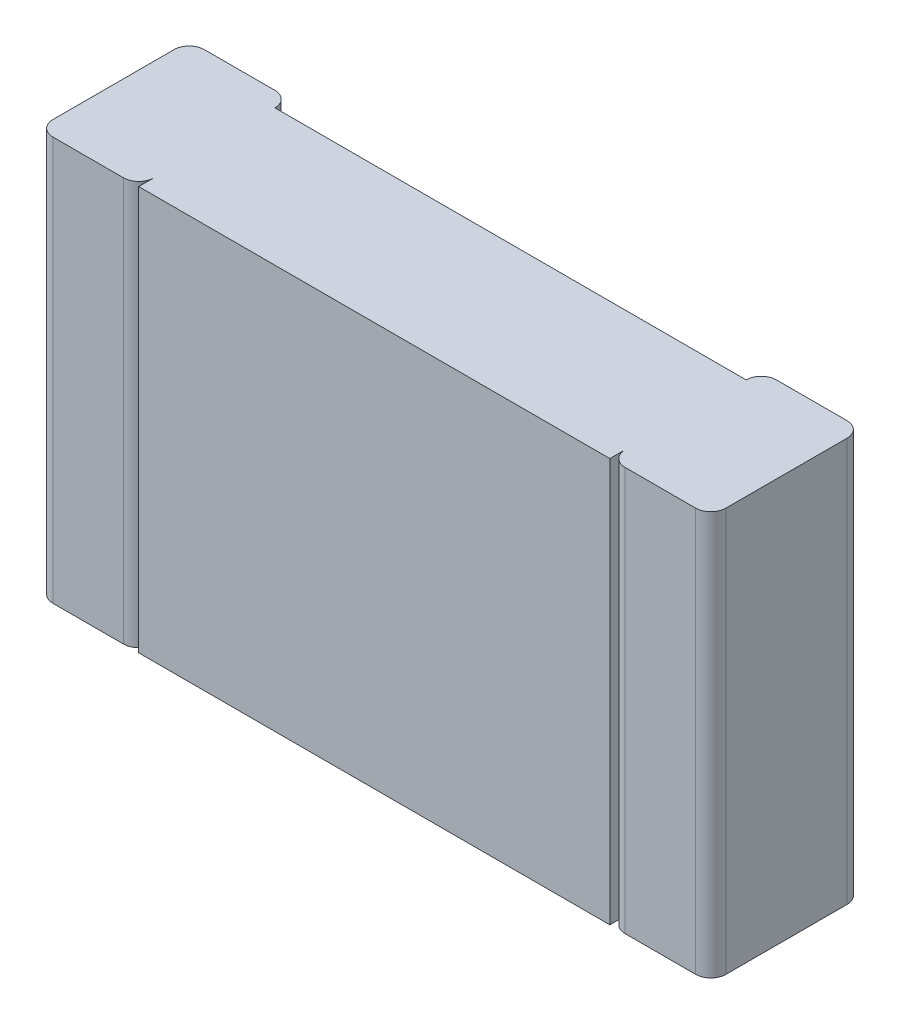
ISO-10303-21;
HEADER;
FILE_DESCRIPTION(('STEP AP214'),'2;1');
FILE_NAME('part.step','',(''),(''),'','','');
FILE_SCHEMA(('AUTOMOTIVE_DESIGN { 1 0 10303 214 1 1 1 1 }'));
ENDSEC;
DATA;
#1=APPLICATION_CONTEXT('core data for automotive mechanical design processes');
#2=APPLICATION_PROTOCOL_DEFINITION('international standard','automotive_design',2000,#1);
#3=PRODUCT_CONTEXT('',#1,'mechanical');
#4=PRODUCT('Part','Part','',(#3));
#5=PRODUCT_RELATED_PRODUCT_CATEGORY('part','',(#4));
#6=PRODUCT_DEFINITION_FORMATION('','',#4);
#7=PRODUCT_DEFINITION_CONTEXT('part definition',#1,'design');
#8=PRODUCT_DEFINITION('design','',#6,#7);
#9=PRODUCT_DEFINITION_SHAPE('','',#8);
#10=(LENGTH_UNIT() NAMED_UNIT(*) SI_UNIT(.MILLI.,.METRE.));
#11=(NAMED_UNIT(*) PLANE_ANGLE_UNIT() SI_UNIT($,.RADIAN.));
#12=(NAMED_UNIT(*) SI_UNIT($,.STERADIAN.) SOLID_ANGLE_UNIT());
#13=UNCERTAINTY_MEASURE_WITH_UNIT(LENGTH_MEASURE(1.E-05),#10,'distance_accuracy_value','');
#14=(GEOMETRIC_REPRESENTATION_CONTEXT(3) GLOBAL_UNCERTAINTY_ASSIGNED_CONTEXT((#13)) GLOBAL_UNIT_ASSIGNED_CONTEXT((#10,
#11,#12)) REPRESENTATION_CONTEXT('',''));
#15=CARTESIAN_POINT('',(0.,0.,0.));
#16=DIRECTION('',(0.,0.,1.));
#17=DIRECTION('',(1.,0.,0.));
#18=AXIS2_PLACEMENT_3D('',#15,#16,#17);
#19=CARTESIAN_POINT('',(-0.955,-0.6,0.045));
#20=DIRECTION('',(0.,1.,0.));
#21=DIRECTION('',(0.,0.,1.));
#22=AXIS2_PLACEMENT_3D('',#19,#20,#21);
#23=CYLINDRICAL_SURFACE('',#22,0.045);
#24=DIRECTION('',(0.,1.,0.));
#25=VECTOR('',#24,1.);
#26=CARTESIAN_POINT('',(-0.955,-0.6,0.));
#27=LINE('',#26,#25);
#28=CARTESIAN_POINT('',(-0.955,0.6,0.));
#29=VERTEX_POINT('',#28);
#30=CARTESIAN_POINT('',(-0.955,-0.6,0.));
#31=VERTEX_POINT('',#30);
#32=EDGE_CURVE('E129',#29,#31,#27,.F.);
#33=ORIENTED_EDGE('',*,*,#32,.T.);
#34=CARTESIAN_POINT('',(-0.955,-0.6,0.045));
#35=DIRECTION('',(0.,1.,0.));
#36=DIRECTION('',(0.,0.,1.));
#37=AXIS2_PLACEMENT_3D('',#34,#35,#36);
#38=CIRCLE('',#37,0.045);
#39=CARTESIAN_POINT('',(-1.,-0.6,0.045));
#40=VERTEX_POINT('',#39);
#41=EDGE_CURVE('E20',#31,#40,#38,.T.);
#42=ORIENTED_EDGE('',*,*,#41,.T.);
#43=DIRECTION('',(0.,1.,0.));
#44=VECTOR('',#43,1.);
#45=CARTESIAN_POINT('',(-1.,-0.6,0.045));
#46=LINE('',#45,#44);
#47=CARTESIAN_POINT('',(-1.,0.6,0.045));
#48=VERTEX_POINT('',#47);
#49=EDGE_CURVE('E136',#40,#48,#46,.T.);
#50=ORIENTED_EDGE('',*,*,#49,.T.);
#51=CARTESIAN_POINT('',(-0.955,0.6,0.045));
#52=DIRECTION('',(0.,1.,0.));
#53=DIRECTION('',(0.,0.,1.));
#54=AXIS2_PLACEMENT_3D('',#51,#52,#53);
#55=CIRCLE('',#54,0.045);
#56=EDGE_CURVE('E232',#29,#48,#55,.T.);
#57=ORIENTED_EDGE('',*,*,#56,.F.);
#58=EDGE_LOOP('',(#33,#42,#50,#57));
#59=FACE_BOUND('',#58,.T.);
#60=ADVANCED_FACE('F17',(#59),#23,.T.);
#61=CARTESIAN_POINT('',(-1.,-0.6,0.));
#62=DIRECTION('',(1.,0.,0.));
#63=DIRECTION('',(0.,0.,-1.));
#64=AXIS2_PLACEMENT_3D('',#61,#62,#63);
#65=PLANE('',#64);
#66=DIRECTION('',(0.,0.,1.));
#67=VECTOR('',#66,1.);
#68=CARTESIAN_POINT('',(-1.,0.6,0.));
#69=LINE('',#68,#67);
#70=CARTESIAN_POINT('',(-1.,0.6,0.405));
#71=VERTEX_POINT('',#70);
#72=EDGE_CURVE('E141',#48,#71,#69,.T.);
#73=ORIENTED_EDGE('',*,*,#72,.F.);
#74=ORIENTED_EDGE('',*,*,#49,.F.);
#75=DIRECTION('',(0.,0.,1.));
#76=VECTOR('',#75,1.);
#77=CARTESIAN_POINT('',(-1.,-0.6,0.));
#78=LINE('',#77,#76);
#79=CARTESIAN_POINT('',(-1.,-0.6,0.405));
#80=VERTEX_POINT('',#79);
#81=EDGE_CURVE('E140',#40,#80,#78,.T.);
#82=ORIENTED_EDGE('',*,*,#81,.T.);
#83=DIRECTION('',(0.,1.,0.));
#84=VECTOR('',#83,1.);
#85=CARTESIAN_POINT('',(-1.,-0.6,0.405));
#86=LINE('',#85,#84);
#87=EDGE_CURVE('E142',#71,#80,#86,.F.);
#88=ORIENTED_EDGE('',*,*,#87,.F.);
#89=EDGE_LOOP('',(#73,#74,#82,#88));
#90=FACE_BOUND('',#89,.T.);
#91=ADVANCED_FACE('F138',(#90),#65,.F.);
#92=CARTESIAN_POINT('',(-0.955,-0.6,0.405));
#93=DIRECTION('',(0.,1.,0.));
#94=DIRECTION('',(0.,0.,1.));
#95=AXIS2_PLACEMENT_3D('',#92,#93,#94);
#96=CYLINDRICAL_SURFACE('',#95,0.045);
#97=CARTESIAN_POINT('',(-0.955,0.6,0.405));
#98=DIRECTION('',(0.,1.,0.));
#99=DIRECTION('',(0.,0.,1.));
#100=AXIS2_PLACEMENT_3D('',#97,#98,#99);
#101=CIRCLE('',#100,0.045);
#102=CARTESIAN_POINT('',(-0.955,0.6,0.45));
#103=VERTEX_POINT('',#102);
#104=EDGE_CURVE('E230',#71,#103,#101,.T.);
#105=ORIENTED_EDGE('',*,*,#104,.F.);
#106=ORIENTED_EDGE('',*,*,#87,.T.);
#107=CARTESIAN_POINT('',(-0.955,-0.6,0.405));
#108=DIRECTION('',(0.,1.,0.));
#109=DIRECTION('',(0.,0.,1.));
#110=AXIS2_PLACEMENT_3D('',#107,#108,#109);
#111=CIRCLE('',#110,0.045);
#112=CARTESIAN_POINT('',(-0.955,-0.6,0.45));
#113=VERTEX_POINT('',#112);
#114=EDGE_CURVE('E151',#80,#113,#111,.T.);
#115=ORIENTED_EDGE('',*,*,#114,.T.);
#116=DIRECTION('',(0.,1.,0.));
#117=VECTOR('',#116,1.);
#118=CARTESIAN_POINT('',(-0.955,-0.6,0.45));
#119=LINE('',#118,#117);
#120=EDGE_CURVE('E200',#103,#113,#119,.F.);
#121=ORIENTED_EDGE('',*,*,#120,.F.);
#122=EDGE_LOOP('',(#105,#106,#115,#121));
#123=FACE_BOUND('',#122,.T.);
#124=ADVANCED_FACE('F457',(#123),#96,.T.);
#125=CARTESIAN_POINT('',(-1.,-0.6,0.45));
#126=DIRECTION('',(0.,0.,1.));
#127=DIRECTION('',(1.,0.,0.));
#128=AXIS2_PLACEMENT_3D('',#125,#126,#127);
#129=PLANE('',#128);
#130=DIRECTION('',(1.,0.,0.));
#131=VECTOR('',#130,1.);
#132=CARTESIAN_POINT('',(-1.,-0.6,0.45));
#133=LINE('',#132,#131);
#134=CARTESIAN_POINT('',(-0.745,-0.6,0.45));
#135=VERTEX_POINT('',#134);
#136=EDGE_CURVE('E248',#113,#135,#133,.T.);
#137=ORIENTED_EDGE('',*,*,#136,.T.);
#138=DIRECTION('',(0.,1.,0.));
#139=VECTOR('',#138,1.);
#140=CARTESIAN_POINT('',(-0.745,-0.6,0.45));
#141=LINE('',#140,#139);
#142=CARTESIAN_POINT('',(-0.745,0.6,0.45));
#143=VERTEX_POINT('',#142);
#144=EDGE_CURVE('E198',#143,#135,#141,.F.);
#145=ORIENTED_EDGE('',*,*,#144,.F.);
#146=DIRECTION('',(1.,0.,0.));
#147=VECTOR('',#146,1.);
#148=CARTESIAN_POINT('',(-1.,0.6,0.45));
#149=LINE('',#148,#147);
#150=EDGE_CURVE('E229',#103,#143,#149,.T.);
#151=ORIENTED_EDGE('',*,*,#150,.F.);
#152=ORIENTED_EDGE('',*,*,#120,.T.);
#153=EDGE_LOOP('',(#137,#145,#151,#152));
#154=FACE_BOUND('',#153,.T.);
#155=ADVANCED_FACE('F447',(#154),#129,.T.);
#156=CARTESIAN_POINT('',(-0.745,-0.6,0.405));
#157=DIRECTION('',(0.,1.,0.));
#158=DIRECTION('',(0.,0.,1.));
#159=AXIS2_PLACEMENT_3D('',#156,#157,#158);
#160=CYLINDRICAL_SURFACE('',#159,0.045);
#161=ORIENTED_EDGE('',*,*,#144,.T.);
#162=CARTESIAN_POINT('',(-0.745,-0.6,0.405));
#163=DIRECTION('',(0.,1.,0.));
#164=DIRECTION('',(0.,0.,1.));
#165=AXIS2_PLACEMENT_3D('',#162,#163,#164);
#166=CIRCLE('',#165,0.045);
#167=CARTESIAN_POINT('',(-0.7,-0.6,0.405));
#168=VERTEX_POINT('',#167);
#169=EDGE_CURVE('E246',#135,#168,#166,.T.);
#170=ORIENTED_EDGE('',*,*,#169,.T.);
#171=DIRECTION('',(0.,1.,0.));
#172=VECTOR('',#171,1.);
#173=CARTESIAN_POINT('',(-0.7,-0.6,0.405));
#174=LINE('',#173,#172);
#175=CARTESIAN_POINT('',(-0.7,0.6,0.405));
#176=VERTEX_POINT('',#175);
#177=EDGE_CURVE('E193',#168,#176,#174,.T.);
#178=ORIENTED_EDGE('',*,*,#177,.T.);
#179=CARTESIAN_POINT('',(-0.745,0.6,0.405));
#180=DIRECTION('',(0.,1.,0.));
#181=DIRECTION('',(0.,0.,1.));
#182=AXIS2_PLACEMENT_3D('',#179,#180,#181);
#183=CIRCLE('',#182,0.045);
#184=EDGE_CURVE('E227',#143,#176,#183,.T.);
#185=ORIENTED_EDGE('',*,*,#184,.F.);
#186=EDGE_LOOP('',(#161,#170,#178,#185));
#187=FACE_BOUND('',#186,.T.);
#188=ADVANCED_FACE('F435',(#187),#160,.T.);
#189=CARTESIAN_POINT('',(-0.7,-0.6,0.405));
#190=DIRECTION('',(1.,0.,0.));
#191=DIRECTION('',(0.,0.,-1.));
#192=AXIS2_PLACEMENT_3D('',#189,#190,#191);
#193=PLANE('',#192);
#194=DIRECTION('',(0.,0.,1.));
#195=VECTOR('',#194,1.);
#196=CARTESIAN_POINT('',(-0.7,0.6,0.405));
#197=LINE('',#196,#195);
#198=CARTESIAN_POINT('',(-0.7,0.6,0.45));
#199=VERTEX_POINT('',#198);
#200=EDGE_CURVE('E188',#176,#199,#197,.T.);
#201=ORIENTED_EDGE('',*,*,#200,.F.);
#202=ORIENTED_EDGE('',*,*,#177,.F.);
#203=DIRECTION('',(0.,0.,1.));
#204=VECTOR('',#203,1.);
#205=CARTESIAN_POINT('',(-0.7,-0.6,0.405));
#206=LINE('',#205,#204);
#207=CARTESIAN_POINT('',(-0.7,-0.6,0.45));
#208=VERTEX_POINT('',#207);
#209=EDGE_CURVE('E206',#168,#208,#206,.T.);
#210=ORIENTED_EDGE('',*,*,#209,.T.);
#211=DIRECTION('',(0.,1.,0.));
#212=VECTOR('',#211,1.);
#213=CARTESIAN_POINT('',(-0.7,-0.6,0.45));
#214=LINE('',#213,#212);
#215=EDGE_CURVE('E181',#199,#208,#214,.F.);
#216=ORIENTED_EDGE('',*,*,#215,.F.);
#217=EDGE_LOOP('',(#201,#202,#210,#216));
#218=FACE_BOUND('',#217,.T.);
#219=ADVANCED_FACE('F425',(#218),#193,.F.);
#220=CARTESIAN_POINT('',(-0.7,-0.6,0.45));
#221=DIRECTION('',(0.,0.,1.));
#222=DIRECTION('',(1.,0.,0.));
#223=AXIS2_PLACEMENT_3D('',#220,#221,#222);
#224=PLANE('',#223);
#225=DIRECTION('',(0.,1.,0.));
#226=VECTOR('',#225,1.);
#227=CARTESIAN_POINT('',(0.7,-0.6,0.45));
#228=LINE('',#227,#226);
#229=CARTESIAN_POINT('',(0.7,0.6,0.45));
#230=VERTEX_POINT('',#229);
#231=CARTESIAN_POINT('',(0.7,-0.6,0.45));
#232=VERTEX_POINT('',#231);
#233=EDGE_CURVE('E174',#230,#232,#228,.F.);
#234=ORIENTED_EDGE('',*,*,#233,.F.);
#235=DIRECTION('',(1.,0.,0.));
#236=VECTOR('',#235,1.);
#237=CARTESIAN_POINT('',(-0.7,0.6,0.45));
#238=LINE('',#237,#236);
#239=EDGE_CURVE('E184',#199,#230,#238,.T.);
#240=ORIENTED_EDGE('',*,*,#239,.F.);
#241=ORIENTED_EDGE('',*,*,#215,.T.);
#242=DIRECTION('',(1.,0.,0.));
#243=VECTOR('',#242,1.);
#244=CARTESIAN_POINT('',(-0.7,-0.6,0.45));
#245=LINE('',#244,#243);
#246=EDGE_CURVE('E203',#208,#232,#245,.T.);
#247=ORIENTED_EDGE('',*,*,#246,.T.);
#248=EDGE_LOOP('',(#234,#240,#241,#247));
#249=FACE_BOUND('',#248,.T.);
#250=ADVANCED_FACE('F412',(#249),#224,.T.);
#251=CARTESIAN_POINT('',(0.7,-0.6,0.405));
#252=DIRECTION('',(1.,0.,0.));
#253=DIRECTION('',(0.,0.,-1.));
#254=AXIS2_PLACEMENT_3D('',#251,#252,#253);
#255=PLANE('',#254);
#256=DIRECTION('',(0.,0.,1.));
#257=VECTOR('',#256,1.);
#258=CARTESIAN_POINT('',(0.7,0.6,0.405));
#259=LINE('',#258,#257);
#260=CARTESIAN_POINT('',(0.7,0.6,0.405));
#261=VERTEX_POINT('',#260);
#262=EDGE_CURVE('E187',#230,#261,#259,.F.);
#263=ORIENTED_EDGE('',*,*,#262,.F.);
#264=ORIENTED_EDGE('',*,*,#233,.T.);
#265=DIRECTION('',(0.,0.,1.));
#266=VECTOR('',#265,1.);
#267=CARTESIAN_POINT('',(0.7,-0.6,0.405));
#268=LINE('',#267,#266);
#269=CARTESIAN_POINT('',(0.7,-0.6,0.405));
#270=VERTEX_POINT('',#269);
#271=EDGE_CURVE('E178',#232,#270,#268,.F.);
#272=ORIENTED_EDGE('',*,*,#271,.T.);
#273=DIRECTION('',(0.,1.,0.));
#274=VECTOR('',#273,1.);
#275=CARTESIAN_POINT('',(0.7,-0.6,0.405));
#276=LINE('',#275,#274);
#277=EDGE_CURVE('E172',#261,#270,#276,.F.);
#278=ORIENTED_EDGE('',*,*,#277,.F.);
#279=EDGE_LOOP('',(#263,#264,#272,#278));
#280=FACE_BOUND('',#279,.T.);
#281=ADVANCED_FACE('F377',(#280),#255,.T.);
#282=CARTESIAN_POINT('',(0.745,-0.6,0.405));
#283=DIRECTION('',(0.,1.,0.));
#284=DIRECTION('',(0.,0.,1.));
#285=AXIS2_PLACEMENT_3D('',#282,#283,#284);
#286=CYLINDRICAL_SURFACE('',#285,0.045);
#287=CARTESIAN_POINT('',(0.745,0.6,0.405));
#288=DIRECTION('',(0.,1.,0.));
#289=DIRECTION('',(0.,0.,1.));
#290=AXIS2_PLACEMENT_3D('',#287,#288,#289);
#291=CIRCLE('',#290,0.045);
#292=CARTESIAN_POINT('',(0.745,0.6,0.45));
#293=VERTEX_POINT('',#292);
#294=EDGE_CURVE('E224',#261,#293,#291,.T.);
#295=ORIENTED_EDGE('',*,*,#294,.F.);
#296=ORIENTED_EDGE('',*,*,#277,.T.);
#297=CARTESIAN_POINT('',(0.745,-0.6,0.405));
#298=DIRECTION('',(0.,1.,0.));
#299=DIRECTION('',(0.,0.,1.));
#300=AXIS2_PLACEMENT_3D('',#297,#298,#299);
#301=CIRCLE('',#300,0.045);
#302=CARTESIAN_POINT('',(0.745,-0.6,0.45));
#303=VERTEX_POINT('',#302);
#304=EDGE_CURVE('E243',#270,#303,#301,.T.);
#305=ORIENTED_EDGE('',*,*,#304,.T.);
#306=DIRECTION('',(0.,1.,0.));
#307=VECTOR('',#306,1.);
#308=CARTESIAN_POINT('',(0.745,-0.6,0.45));
#309=LINE('',#308,#307);
#310=EDGE_CURVE('E170',#293,#303,#309,.F.);
#311=ORIENTED_EDGE('',*,*,#310,.F.);
#312=EDGE_LOOP('',(#295,#296,#305,#311));
#313=FACE_BOUND('',#312,.T.);
#314=ADVANCED_FACE('F411',(#313),#286,.T.);
#315=CARTESIAN_POINT('',(0.7,-0.6,0.45));
#316=DIRECTION('',(0.,0.,1.));
#317=DIRECTION('',(1.,0.,0.));
#318=AXIS2_PLACEMENT_3D('',#315,#316,#317);
#319=PLANE('',#318);
#320=DIRECTION('',(1.,0.,0.));
#321=VECTOR('',#320,1.);
#322=CARTESIAN_POINT('',(0.7,-0.6,0.45));
#323=LINE('',#322,#321);
#324=CARTESIAN_POINT('',(0.955,-0.6,0.45));
#325=VERTEX_POINT('',#324);
#326=EDGE_CURVE('E242',#303,#325,#323,.T.);
#327=ORIENTED_EDGE('',*,*,#326,.T.);
#328=DIRECTION('',(0.,1.,0.));
#329=VECTOR('',#328,1.);
#330=CARTESIAN_POINT('',(0.955,-0.6,0.45));
#331=LINE('',#330,#329);
#332=CARTESIAN_POINT('',(0.955,0.6,0.45));
#333=VERTEX_POINT('',#332);
#334=EDGE_CURVE('E168',#333,#325,#331,.F.);
#335=ORIENTED_EDGE('',*,*,#334,.F.);
#336=DIRECTION('',(1.,0.,0.));
#337=VECTOR('',#336,1.);
#338=CARTESIAN_POINT('',(0.7,0.6,0.45));
#339=LINE('',#338,#337);
#340=EDGE_CURVE('E223',#293,#333,#339,.T.);
#341=ORIENTED_EDGE('',*,*,#340,.F.);
#342=ORIENTED_EDGE('',*,*,#310,.T.);
#343=EDGE_LOOP('',(#327,#335,#341,#342));
#344=FACE_BOUND('',#343,.T.);
#345=ADVANCED_FACE('F488',(#344),#319,.T.);
#346=CARTESIAN_POINT('',(0.955,-0.6,0.405));
#347=DIRECTION('',(0.,1.,0.));
#348=DIRECTION('',(0.,0.,1.));
#349=AXIS2_PLACEMENT_3D('',#346,#347,#348);
#350=CYLINDRICAL_SURFACE('',#349,0.045);
#351=ORIENTED_EDGE('',*,*,#334,.T.);
#352=CARTESIAN_POINT('',(0.955,-0.6,0.405));
#353=DIRECTION('',(0.,1.,0.));
#354=DIRECTION('',(0.,0.,1.));
#355=AXIS2_PLACEMENT_3D('',#352,#353,#354);
#356=CIRCLE('',#355,0.045);
#357=CARTESIAN_POINT('',(1.,-0.6,0.405));
#358=VERTEX_POINT('',#357);
#359=EDGE_CURVE('E239',#325,#358,#356,.T.);
#360=ORIENTED_EDGE('',*,*,#359,.T.);
#361=DIRECTION('',(0.,1.,0.));
#362=VECTOR('',#361,1.);
#363=CARTESIAN_POINT('',(1.,-0.6,0.405));
#364=LINE('',#363,#362);
#365=CARTESIAN_POINT('',(1.,0.6,0.405));
#366=VERTEX_POINT('',#365);
#367=EDGE_CURVE('E166',#366,#358,#364,.F.);
#368=ORIENTED_EDGE('',*,*,#367,.F.);
#369=CARTESIAN_POINT('',(0.955,0.6,0.405));
#370=DIRECTION('',(0.,1.,0.));
#371=DIRECTION('',(0.,0.,1.));
#372=AXIS2_PLACEMENT_3D('',#369,#370,#371);
#373=CIRCLE('',#372,0.045);
#374=EDGE_CURVE('E221',#333,#366,#373,.T.);
#375=ORIENTED_EDGE('',*,*,#374,.F.);
#376=EDGE_LOOP('',(#351,#360,#368,#375));
#377=FACE_BOUND('',#376,.T.);
#378=ADVANCED_FACE('F492',(#377),#350,.T.);
#379=CARTESIAN_POINT('',(1.,-0.6,0.));
#380=DIRECTION('',(1.,0.,0.));
#381=DIRECTION('',(0.,0.,-1.));
#382=AXIS2_PLACEMENT_3D('',#379,#380,#381);
#383=PLANE('',#382);
#384=DIRECTION('',(0.,0.,1.));
#385=VECTOR('',#384,1.);
#386=CARTESIAN_POINT('',(1.,0.6,0.));
#387=LINE('',#386,#385);
#388=CARTESIAN_POINT('',(1.,0.6,0.045));
#389=VERTEX_POINT('',#388);
#390=EDGE_CURVE('E220',#366,#389,#387,.F.);
#391=ORIENTED_EDGE('',*,*,#390,.F.);
#392=ORIENTED_EDGE('',*,*,#367,.T.);
#393=DIRECTION('',(0.,0.,1.));
#394=VECTOR('',#393,1.);
#395=CARTESIAN_POINT('',(1.,-0.6,0.));
#396=LINE('',#395,#394);
#397=CARTESIAN_POINT('',(1.,-0.6,0.045));
#398=VERTEX_POINT('',#397);
#399=EDGE_CURVE('E238',#358,#398,#396,.F.);
#400=ORIENTED_EDGE('',*,*,#399,.T.);
#401=DIRECTION('',(0.,1.,0.));
#402=VECTOR('',#401,1.);
#403=CARTESIAN_POINT('',(1.,-0.6,0.045));
#404=LINE('',#403,#402);
#405=EDGE_CURVE('E157',#389,#398,#404,.F.);
#406=ORIENTED_EDGE('',*,*,#405,.F.);
#407=EDGE_LOOP('',(#391,#392,#400,#406));
#408=FACE_BOUND('',#407,.T.);
#409=ADVANCED_FACE('F298',(#408),#383,.T.);
#410=CARTESIAN_POINT('',(0.955,-0.6,0.045));
#411=DIRECTION('',(0.,1.,0.));
#412=DIRECTION('',(0.,0.,1.));
#413=AXIS2_PLACEMENT_3D('',#410,#411,#412);
#414=CYLINDRICAL_SURFACE('',#413,0.045);
#415=CARTESIAN_POINT('',(0.955,0.6,0.045));
#416=DIRECTION('',(0.,1.,0.));
#417=DIRECTION('',(0.,0.,1.));
#418=AXIS2_PLACEMENT_3D('',#415,#416,#417);
#419=CIRCLE('',#418,0.045);
#420=CARTESIAN_POINT('',(0.955,0.6,0.));
#421=VERTEX_POINT('',#420);
#422=EDGE_CURVE('E217',#389,#421,#419,.T.);
#423=ORIENTED_EDGE('',*,*,#422,.F.);
#424=ORIENTED_EDGE('',*,*,#405,.T.);
#425=CARTESIAN_POINT('',(0.955,-0.6,0.045));
#426=DIRECTION('',(0.,1.,0.));
#427=DIRECTION('',(0.,0.,1.));
#428=AXIS2_PLACEMENT_3D('',#425,#426,#427);
#429=CIRCLE('',#428,0.045);
#430=CARTESIAN_POINT('',(0.955,-0.6,0.));
#431=VERTEX_POINT('',#430);
#432=EDGE_CURVE('E235',#398,#431,#429,.T.);
#433=ORIENTED_EDGE('',*,*,#432,.T.);
#434=DIRECTION('',(0.,1.,0.));
#435=VECTOR('',#434,1.);
#436=CARTESIAN_POINT('',(0.955,-0.6,0.));
#437=LINE('',#436,#435);
#438=EDGE_CURVE('E175',#431,#421,#437,.T.);
#439=ORIENTED_EDGE('',*,*,#438,.T.);
#440=EDGE_LOOP('',(#423,#424,#433,#439));
#441=FACE_BOUND('',#440,.T.);
#442=ADVANCED_FACE('F302',(#441),#414,.T.);
#443=CARTESIAN_POINT('',(-1.,-0.6,0.));
#444=DIRECTION('',(0.,0.,1.));
#445=DIRECTION('',(1.,0.,0.));
#446=AXIS2_PLACEMENT_3D('',#443,#444,#445);
#447=PLANE('',#446);
#448=DIRECTION('',(1.,0.,0.));
#449=VECTOR('',#448,1.);
#450=CARTESIAN_POINT('',(-1.,-0.6,0.));
#451=LINE('',#450,#449);
#452=CARTESIAN_POINT('',(-0.745,-0.6,0.));
#453=VERTEX_POINT('',#452);
#454=EDGE_CURVE('E153',#453,#31,#451,.F.);
#455=ORIENTED_EDGE('',*,*,#454,.T.);
#456=ORIENTED_EDGE('',*,*,#32,.F.);
#457=DIRECTION('',(1.,0.,0.));
#458=VECTOR('',#457,1.);
#459=CARTESIAN_POINT('',(-1.,0.6,0.));
#460=LINE('',#459,#458);
#461=CARTESIAN_POINT('',(-0.745,0.6,0.));
#462=VERTEX_POINT('',#461);
#463=EDGE_CURVE('E234',#462,#29,#460,.F.);
#464=ORIENTED_EDGE('',*,*,#463,.F.);
#465=DIRECTION('',(0.,1.,0.));
#466=VECTOR('',#465,1.);
#467=CARTESIAN_POINT('',(-0.745,-0.6,0.));
#468=LINE('',#467,#466);
#469=EDGE_CURVE('E161',#453,#462,#468,.T.);
#470=ORIENTED_EDGE('',*,*,#469,.F.);
#471=EDGE_LOOP('',(#455,#456,#464,#470));
#472=FACE_BOUND('',#471,.T.);
#473=ADVANCED_FACE('F319',(#472),#447,.F.);
#474=CARTESIAN_POINT('',(0.7,-0.6,0.));
#475=DIRECTION('',(0.,0.,1.));
#476=DIRECTION('',(1.,0.,0.));
#477=AXIS2_PLACEMENT_3D('',#474,#475,#476);
#478=PLANE('',#477);
#479=DIRECTION('',(1.,0.,0.));
#480=VECTOR('',#479,1.);
#481=CARTESIAN_POINT('',(0.7,-0.6,0.));
#482=LINE('',#481,#480);
#483=CARTESIAN_POINT('',(0.745,-0.6,0.));
#484=VERTEX_POINT('',#483);
#485=EDGE_CURVE('E177',#431,#484,#482,.F.);
#486=ORIENTED_EDGE('',*,*,#485,.T.);
#487=DIRECTION('',(0.,1.,0.));
#488=VECTOR('',#487,1.);
#489=CARTESIAN_POINT('',(0.745,-0.6,0.));
#490=LINE('',#489,#488);
#491=CARTESIAN_POINT('',(0.745,0.6,0.));
#492=VERTEX_POINT('',#491);
#493=EDGE_CURVE('E212',#492,#484,#490,.F.);
#494=ORIENTED_EDGE('',*,*,#493,.F.);
#495=DIRECTION('',(1.,0.,0.));
#496=VECTOR('',#495,1.);
#497=CARTESIAN_POINT('',(0.7,0.6,0.));
#498=LINE('',#497,#496);
#499=EDGE_CURVE('E226',#421,#492,#498,.F.);
#500=ORIENTED_EDGE('',*,*,#499,.F.);
#501=ORIENTED_EDGE('',*,*,#438,.F.);
#502=EDGE_LOOP('',(#486,#494,#500,#501));
#503=FACE_BOUND('',#502,.T.);
#504=ADVANCED_FACE('F305',(#503),#478,.F.);
#505=CARTESIAN_POINT('',(-0.745,-0.6,0.045));
#506=DIRECTION('',(0.,1.,0.));
#507=DIRECTION('',(0.,0.,1.));
#508=AXIS2_PLACEMENT_3D('',#505,#506,#507);
#509=CYLINDRICAL_SURFACE('',#508,0.045);
#510=CARTESIAN_POINT('',(-0.745,0.6,0.045));
#511=DIRECTION('',(0.,1.,0.));
#512=DIRECTION('',(0.,0.,1.));
#513=AXIS2_PLACEMENT_3D('',#510,#511,#512);
#514=CIRCLE('',#513,0.045);
#515=CARTESIAN_POINT('',(-0.7,0.6,0.045));
#516=VERTEX_POINT('',#515);
#517=EDGE_CURVE('E163',#462,#516,#514,.F.);
#518=ORIENTED_EDGE('',*,*,#517,.T.);
#519=DIRECTION('',(0.,1.,0.));
#520=VECTOR('',#519,1.);
#521=CARTESIAN_POINT('',(-0.7,-0.6,0.045));
#522=LINE('',#521,#520);
#523=CARTESIAN_POINT('',(-0.7,-0.6,0.045));
#524=VERTEX_POINT('',#523);
#525=EDGE_CURVE('E211',#516,#524,#522,.F.);
#526=ORIENTED_EDGE('',*,*,#525,.T.);
#527=CARTESIAN_POINT('',(-0.745,-0.6,0.045));
#528=DIRECTION('',(0.,1.,0.));
#529=DIRECTION('',(0.,0.,1.));
#530=AXIS2_PLACEMENT_3D('',#527,#528,#529);
#531=CIRCLE('',#530,0.045);
#532=EDGE_CURVE('E164',#524,#453,#531,.T.);
#533=ORIENTED_EDGE('',*,*,#532,.T.);
#534=ORIENTED_EDGE('',*,*,#469,.T.);
#535=EDGE_LOOP('',(#518,#526,#533,#534));
#536=FACE_BOUND('',#535,.T.);
#537=ADVANCED_FACE('F318',(#536),#509,.T.);
#538=CARTESIAN_POINT('',(-0.955,-0.6,0.045));
#539=DIRECTION('',(0.,1.,0.));
#540=DIRECTION('',(0.,0.,1.));
#541=AXIS2_PLACEMENT_3D('',#538,#539,#540);
#542=PLANE('',#541);
#543=DIRECTION('',(1.,0.,0.));
#544=VECTOR('',#543,1.);
#545=CARTESIAN_POINT('',(-0.955,-0.6,0.045));
#546=LINE('',#545,#544);
#547=CARTESIAN_POINT('',(0.7,-0.6,0.045));
#548=VERTEX_POINT('',#547);
#549=EDGE_CURVE('E263',#524,#548,#546,.T.);
#550=ORIENTED_EDGE('',*,*,#549,.T.);
#551=CARTESIAN_POINT('',(0.745,-0.6,0.045));
#552=DIRECTION('',(0.,1.,0.));
#553=DIRECTION('',(0.,0.,1.));
#554=AXIS2_PLACEMENT_3D('',#551,#552,#553);
#555=CIRCLE('',#554,0.045);
#556=EDGE_CURVE('E209',#484,#548,#555,.T.);
#557=ORIENTED_EDGE('',*,*,#556,.F.);
#558=ORIENTED_EDGE('',*,*,#485,.F.);
#559=ORIENTED_EDGE('',*,*,#432,.F.);
#560=ORIENTED_EDGE('',*,*,#399,.F.);
#561=ORIENTED_EDGE('',*,*,#359,.F.);
#562=ORIENTED_EDGE('',*,*,#326,.F.);
#563=ORIENTED_EDGE('',*,*,#304,.F.);
#564=ORIENTED_EDGE('',*,*,#271,.F.);
#565=ORIENTED_EDGE('',*,*,#246,.F.);
#566=ORIENTED_EDGE('',*,*,#209,.F.);
#567=ORIENTED_EDGE('',*,*,#169,.F.);
#568=ORIENTED_EDGE('',*,*,#136,.F.);
#569=ORIENTED_EDGE('',*,*,#114,.F.);
#570=ORIENTED_EDGE('',*,*,#81,.F.);
#571=ORIENTED_EDGE('',*,*,#41,.F.);
#572=ORIENTED_EDGE('',*,*,#454,.F.);
#573=ORIENTED_EDGE('',*,*,#532,.F.);
#574=EDGE_LOOP('',(#550,#557,#558,#559,#560,#561,#562,#563,#564,#565,#566,#567,#568,#569,#570,
#571,#572,#573));
#575=FACE_BOUND('',#574,.T.);
#576=ADVANCED_FACE('F147',(#575),#542,.F.);
#577=CARTESIAN_POINT('',(0.745,-0.6,0.045));
#578=DIRECTION('',(0.,1.,0.));
#579=DIRECTION('',(0.,0.,1.));
#580=AXIS2_PLACEMENT_3D('',#577,#578,#579);
#581=CYLINDRICAL_SURFACE('',#580,0.045);
#582=ORIENTED_EDGE('',*,*,#493,.T.);
#583=ORIENTED_EDGE('',*,*,#556,.T.);
#584=DIRECTION('',(0.,1.,0.));
#585=VECTOR('',#584,1.);
#586=CARTESIAN_POINT('',(0.7,-0.6,0.045));
#587=LINE('',#586,#585);
#588=CARTESIAN_POINT('',(0.7,0.6,0.045));
#589=VERTEX_POINT('',#588);
#590=EDGE_CURVE('E26',#548,#589,#587,.T.);
#591=ORIENTED_EDGE('',*,*,#590,.T.);
#592=CARTESIAN_POINT('',(0.745,0.6,0.045));
#593=DIRECTION('',(0.,1.,0.));
#594=DIRECTION('',(0.,0.,1.));
#595=AXIS2_PLACEMENT_3D('',#592,#593,#594);
#596=CIRCLE('',#595,0.045);
#597=EDGE_CURVE('E34',#589,#492,#596,.F.);
#598=ORIENTED_EDGE('',*,*,#597,.T.);
#599=EDGE_LOOP('',(#582,#583,#591,#598));
#600=FACE_BOUND('',#599,.T.);
#601=ADVANCED_FACE('F311',(#600),#581,.T.);
#602=CARTESIAN_POINT('',(-0.955,0.6,0.045));
#603=DIRECTION('',(0.,1.,0.));
#604=DIRECTION('',(0.,0.,1.));
#605=AXIS2_PLACEMENT_3D('',#602,#603,#604);
#606=PLANE('',#605);
#607=DIRECTION('',(1.,0.,0.));
#608=VECTOR('',#607,1.);
#609=CARTESIAN_POINT('',(-0.955,0.6,0.045));
#610=LINE('',#609,#608);
#611=EDGE_CURVE('E11',#589,#516,#610,.F.);
#612=ORIENTED_EDGE('',*,*,#611,.T.);
#613=ORIENTED_EDGE('',*,*,#517,.F.);
#614=ORIENTED_EDGE('',*,*,#463,.T.);
#615=ORIENTED_EDGE('',*,*,#56,.T.);
#616=ORIENTED_EDGE('',*,*,#72,.T.);
#617=ORIENTED_EDGE('',*,*,#104,.T.);
#618=ORIENTED_EDGE('',*,*,#150,.T.);
#619=ORIENTED_EDGE('',*,*,#184,.T.);
#620=ORIENTED_EDGE('',*,*,#200,.T.);
#621=ORIENTED_EDGE('',*,*,#239,.T.);
#622=ORIENTED_EDGE('',*,*,#262,.T.);
#623=ORIENTED_EDGE('',*,*,#294,.T.);
#624=ORIENTED_EDGE('',*,*,#340,.T.);
#625=ORIENTED_EDGE('',*,*,#374,.T.);
#626=ORIENTED_EDGE('',*,*,#390,.T.);
#627=ORIENTED_EDGE('',*,*,#422,.T.);
#628=ORIENTED_EDGE('',*,*,#499,.T.);
#629=ORIENTED_EDGE('',*,*,#597,.F.);
#630=EDGE_LOOP('',(#612,#613,#614,#615,#616,#617,#618,#619,#620,#621,#622,#623,#624,#625,#626,
#627,#628,#629));
#631=FACE_BOUND('',#630,.T.);
#632=ADVANCED_FACE('F292',(#631),#606,.T.);
#633=CARTESIAN_POINT('',(-0.955,-0.6,0.045));
#634=DIRECTION('',(0.,0.,1.));
#635=DIRECTION('',(1.,0.,0.));
#636=AXIS2_PLACEMENT_3D('',#633,#634,#635);
#637=PLANE('',#636);
#638=ORIENTED_EDGE('',*,*,#590,.F.);
#639=ORIENTED_EDGE('',*,*,#549,.F.);
#640=ORIENTED_EDGE('',*,*,#525,.F.);
#641=ORIENTED_EDGE('',*,*,#611,.F.);
#642=EDGE_LOOP('',(#638,#639,#640,#641));
#643=FACE_BOUND('',#642,.T.);
#644=ADVANCED_FACE('F313',(#643),#637,.F.);
#645=CLOSED_SHELL('',(#60,#91,#124,#155,#188,#219,#250,#281,#314,#345,#378,#409,#442,#473,#504,
#537,#576,#601,#632,#644));
#646=MANIFOLD_SOLID_BREP('B1',#645);
#647=ADVANCED_BREP_SHAPE_REPRESENTATION('',(#18,#646),#14);
#648=SHAPE_DEFINITION_REPRESENTATION(#9,#647);
ENDSEC;
END-ISO-10303-21;
